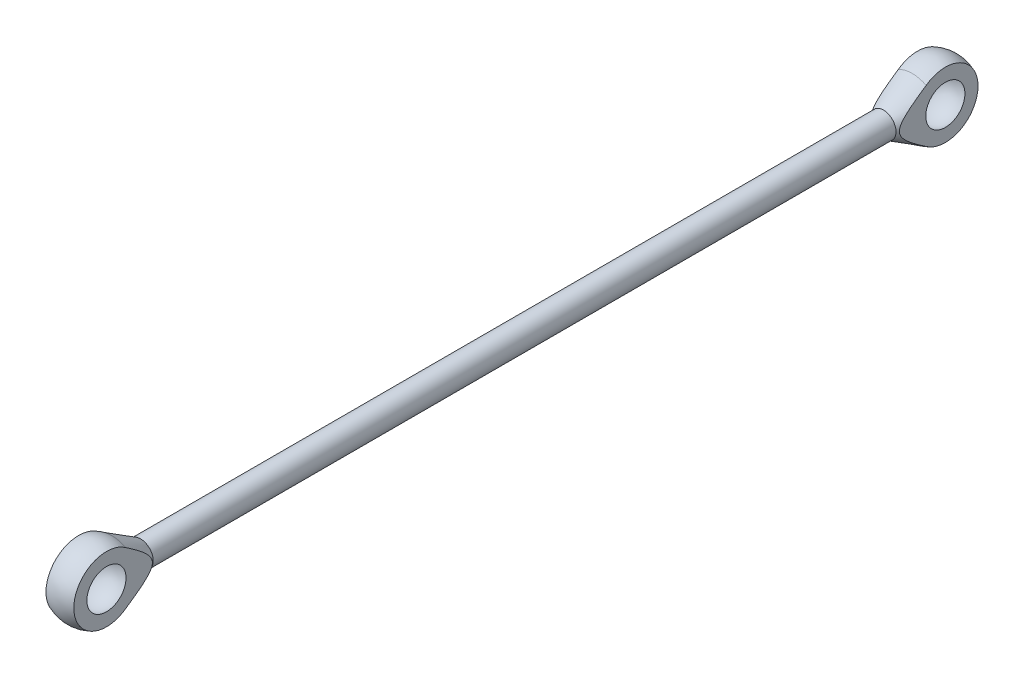
ISO-10303-21;
HEADER;
FILE_DESCRIPTION(('STEP AP214'),'2;1');
FILE_NAME('part.step','',(''),(''),'','','');
FILE_SCHEMA(('AUTOMOTIVE_DESIGN { 1 0 10303 214 1 1 1 1 }'));
ENDSEC;
DATA;
#1=APPLICATION_CONTEXT('core data for automotive mechanical design processes');
#2=APPLICATION_PROTOCOL_DEFINITION('international standard','automotive_design',2000,#1);
#3=PRODUCT_CONTEXT('',#1,'mechanical');
#4=PRODUCT('Part','Part','',(#3));
#5=PRODUCT_RELATED_PRODUCT_CATEGORY('part','',(#4));
#6=PRODUCT_DEFINITION_FORMATION('','',#4);
#7=PRODUCT_DEFINITION_CONTEXT('part definition',#1,'design');
#8=PRODUCT_DEFINITION('design','',#6,#7);
#9=PRODUCT_DEFINITION_SHAPE('','',#8);
#10=(LENGTH_UNIT() NAMED_UNIT(*) SI_UNIT(.MILLI.,.METRE.));
#11=(NAMED_UNIT(*) PLANE_ANGLE_UNIT() SI_UNIT($,.RADIAN.));
#12=(NAMED_UNIT(*) SI_UNIT($,.STERADIAN.) SOLID_ANGLE_UNIT());
#13=UNCERTAINTY_MEASURE_WITH_UNIT(LENGTH_MEASURE(1.E-05),#10,'distance_accuracy_value','');
#14=(GEOMETRIC_REPRESENTATION_CONTEXT(3) GLOBAL_UNCERTAINTY_ASSIGNED_CONTEXT((#13)) GLOBAL_UNIT_ASSIGNED_CONTEXT((#10,
#11,#12)) REPRESENTATION_CONTEXT('',''));
#15=CARTESIAN_POINT('',(0.,0.,0.));
#16=DIRECTION('',(0.,0.,1.));
#17=DIRECTION('',(1.,0.,0.));
#18=AXIS2_PLACEMENT_3D('',#15,#16,#17);
#19=CARTESIAN_POINT('',(0.,0.,19.01));
#20=DIRECTION('',(0.,0.,-1.));
#21=DIRECTION('',(-1.,0.,0.));
#22=AXIS2_PLACEMENT_3D('',#19,#20,#21);
#23=CONICAL_SURFACE('',#22,4.99999999999999,0.538562533862491);
#24=CARTESIAN_POINT('',(0.,0.,19.01));
#25=DIRECTION('',(0.,0.,1.));
#26=DIRECTION('',(1.,0.,0.));
#27=AXIS2_PLACEMENT_3D('',#24,#25,#26);
#28=CIRCLE('',#27,4.99999999999999);
#29=CARTESIAN_POINT('',(5.,0.,19.01));
#30=VERTEX_POINT('',#29);
#31=EDGE_CURVE('E97',#30,#30,#28,.T.);
#32=ORIENTED_EDGE('',*,*,#31,.F.);
#33=EDGE_LOOP('',(#32));
#34=FACE_BOUND('',#33,.T.);
#35=CARTESIAN_POINT('',(0.,0.,7.59617904313834));
#36=DIRECTION('',(0.,0.,-1.));
#37=DIRECTION('',(-1.,0.,0.));
#38=AXIS2_PLACEMENT_3D('',#35,#36,#37);
#39=CIRCLE('',#38,11.8194993102325);
#40=CARTESIAN_POINT('',(5.5,-10.4618623554598,7.59617904313834));
#41=VERTEX_POINT('',#40);
#42=CARTESIAN_POINT('',(-5.5,-10.4618623554598,7.59617904313835));
#43=VERTEX_POINT('',#42);
#44=EDGE_CURVE('E87',#41,#43,#39,.T.);
#45=ORIENTED_EDGE('',*,*,#44,.F.);
#46=CARTESIAN_POINT('',(5.5,-16.7699879539962,-2.16045450294229));
#47=CARTESIAN_POINT('',(5.5,-16.4583835907631,-1.66491515013046));
#48=CARTESIAN_POINT('',(5.5,-16.1461939178694,-1.16974273924281));
#49=CARTESIAN_POINT('',(5.5,-15.5203804705586,-0.18029928682494));
#50=CARTESIAN_POINT('',(5.5,-15.206756684022,0.313971747038282));
#51=CARTESIAN_POINT('',(5.5,-14.5777003040261,1.30161945901528));
#52=CARTESIAN_POINT('',(5.5,-14.2622670835569,1.79499573800298));
#53=CARTESIAN_POINT('',(5.5,-13.6293565999672,2.78043396123766));
#54=CARTESIAN_POINT('',(5.5,-13.3118793434821,3.27249590974389));
#55=CARTESIAN_POINT('',(5.5,-12.6745428201742,4.25482569199551));
#56=CARTESIAN_POINT('',(5.5,-12.3546844470516,4.74509410510819));
#57=CARTESIAN_POINT('',(5.5,-11.7118770373843,5.72359996355387));
#58=CARTESIAN_POINT('',(5.5,-11.3889280121858,6.21183741633325));
#59=CARTESIAN_POINT('',(5.5,-10.7391954567567,7.18561964861333));
#60=CARTESIAN_POINT('',(5.5,-10.4124126934105,7.67116493896215));
#61=CARTESIAN_POINT('',(5.5,-9.75383410271951,8.63883621135109));
#62=CARTESIAN_POINT('',(5.5,-9.42203836183317,9.12096225215252));
#63=CARTESIAN_POINT('',(5.5,-8.75202371300859,10.0803472501875));
#64=CARTESIAN_POINT('',(5.5,-8.41380853172558,10.5576087981055));
#65=CARTESIAN_POINT('',(5.5,-7.89967359976246,11.268687324336));
#66=CARTESIAN_POINT('',(5.5,-7.72713278963645,11.5049472711888));
#67=CARTESIAN_POINT('',(5.5,-7.37936653531155,11.9754836652112));
#68=CARTESIAN_POINT('',(5.5,-7.2041411110706,12.2097601271062));
#69=CARTESIAN_POINT('',(5.5,-6.84980688742612,12.6767789139711));
#70=CARTESIAN_POINT('',(5.5,-6.67068577499181,12.9095119134227));
#71=CARTESIAN_POINT('',(5.5,-6.30853675344257,13.3719165468175));
#72=CARTESIAN_POINT('',(5.5,-6.1255089421552,13.6015882571848));
#73=CARTESIAN_POINT('',(5.5,-5.75475390193778,14.0569173852053));
#74=CARTESIAN_POINT('',(5.5,-5.56702919950236,14.2825768538868));
#75=CARTESIAN_POINT('',(5.5,-5.18563251299146,14.7287987357815));
#76=CARTESIAN_POINT('',(5.5,-4.9919611436177,14.9493616717156));
#77=CARTESIAN_POINT('',(5.5,-4.59532986050416,15.3855828245892));
#78=CARTESIAN_POINT('',(5.5,-4.39230291252337,15.6011803605528));
#79=CARTESIAN_POINT('',(5.5,-3.97616836237411,16.0229155567571));
#80=CARTESIAN_POINT('',(5.5,-3.7630526000596,16.229045284197));
#81=CARTESIAN_POINT('',(5.5,-3.43431266643456,16.5270114574095));
#82=CARTESIAN_POINT('',(5.5,-3.32354493848511,16.6242050418075));
#83=CARTESIAN_POINT('',(5.5,-3.09834890812631,16.8142404870825));
#84=CARTESIAN_POINT('',(5.5,-2.98392121901322,16.9070830706913));
#85=CARTESIAN_POINT('',(5.5,-2.75104952147987,17.0872640153262));
#86=CARTESIAN_POINT('',(5.5,-2.63261145940299,17.174610020153));
#87=CARTESIAN_POINT('',(5.5,-2.39107305587329,17.3425526323686));
#88=CARTESIAN_POINT('',(5.5,-2.26797454793712,17.423151854821));
#89=CARTESIAN_POINT('',(5.5,-2.04513865625886,17.5585093754721));
#90=CARTESIAN_POINT('',(5.5,-1.94644813988529,17.6149781499614));
#91=CARTESIAN_POINT('',(5.5,-1.74584998022267,17.7218255956368));
#92=CARTESIAN_POINT('',(5.5,-1.64394212794569,17.7722038701727));
#93=CARTESIAN_POINT('',(5.5,-1.33345139230971,17.9123073875635));
#94=CARTESIAN_POINT('',(5.5,-1.11964427139642,17.991290577828));
#95=CARTESIAN_POINT('',(5.5,-0.808089736345844,18.075584022622));
#96=CARTESIAN_POINT('',(5.5,-0.714588861533277,18.0971036988214));
#97=CARTESIAN_POINT('',(5.5,-0.526159319821155,18.1324449338877));
#98=CARTESIAN_POINT('',(5.5,-0.431231401710393,18.1462703945237));
#99=CARTESIAN_POINT('',(5.5,-0.240555463549945,18.1657243374299));
#100=CARTESIAN_POINT('',(5.5,-0.144807617825735,18.1713545206171));
#101=CARTESIAN_POINT('',(5.5,0.0468168036116109,18.1742113228258));
#102=CARTESIAN_POINT('',(5.5,0.1426933816112,18.1714377905587));
#103=CARTESIAN_POINT('',(5.5,0.33370348182932,18.1576005628072));
#104=CARTESIAN_POINT('',(5.5,0.428837880309823,18.1465489012371));
#105=CARTESIAN_POINT('',(5.5,0.617874161148759,18.1165843613316));
#106=CARTESIAN_POINT('',(5.5,0.711775518008768,18.0976682367479));
#107=CARTESIAN_POINT('',(5.5,0.990823929511157,18.0300264663378));
#108=CARTESIAN_POINT('',(5.5,1.173389722865,17.9704012488984));
#109=CARTESIAN_POINT('',(5.5,1.50044770452012,17.8398452116475));
#110=CARTESIAN_POINT('',(5.5,1.64634286874576,17.772272151952));
#111=CARTESIAN_POINT('',(5.5,1.93170387943562,17.624532878355));
#112=CARTESIAN_POINT('',(5.5,2.07116462975958,17.5443568969561));
#113=CARTESIAN_POINT('',(5.5,2.3445661171153,17.3739123699473));
#114=CARTESIAN_POINT('',(5.5,2.47847917963017,17.28360001701));
#115=CARTESIAN_POINT('',(5.5,2.74076622119365,17.0954142226783));
#116=CARTESIAN_POINT('',(5.5,2.86914219208851,16.9975435361839));
#117=CARTESIAN_POINT('',(5.5,3.10532713311943,16.8084873877856));
#118=CARTESIAN_POINT('',(5.5,3.21369861274597,16.7179993405327));
#119=CARTESIAN_POINT('',(5.5,3.42722218337715,16.5332914600831));
#120=CARTESIAN_POINT('',(5.5,3.53237390558656,16.439071202208));
#121=CARTESIAN_POINT('',(5.5,3.84370823383102,16.1517227777822));
#122=CARTESIAN_POINT('',(5.5,4.04565301165459,15.9540028254144));
#123=CARTESIAN_POINT('',(5.5,4.44122638644227,15.549565695216));
#124=CARTESIAN_POINT('',(5.5,4.63483326886779,15.3428275508764));
#125=CARTESIAN_POINT('',(5.5,5.01505488168435,14.9231520340683));
#126=CARTESIAN_POINT('',(5.5,5.20167160469701,14.7102164594794));
#127=CARTESIAN_POINT('',(5.5,5.57120857287385,14.2774931520359));
#128=CARTESIAN_POINT('',(5.5,5.7540733012956,14.0576582295168));
#129=CARTESIAN_POINT('',(5.5,6.11525587117383,13.6142723168627));
#130=CARTESIAN_POINT('',(5.5,6.29357342764499,13.3907210952591));
#131=CARTESIAN_POINT('',(5.5,6.64619362154478,12.9410532101398));
#132=CARTESIAN_POINT('',(5.5,6.82050217516087,12.7149411749489));
#133=CARTESIAN_POINT('',(5.5,7.16602299801056,12.260379434849));
#134=CARTESIAN_POINT('',(5.5,7.33723536788028,12.0319298062989));
#135=CARTESIAN_POINT('',(5.5,7.68035099807539,11.5686783755692));
#136=CARTESIAN_POINT('',(5.5,7.8522036530824,11.3338391403543));
#137=CARTESIAN_POINT('',(5.5,8.19362961978857,10.8625083528705));
#138=CARTESIAN_POINT('',(5.5,8.36320290901521,10.6260167843461));
#139=CARTESIAN_POINT('',(5.5,8.86903578254858,9.91445950528944));
#140=CARTESIAN_POINT('',(5.5,9.2023938426723,9.43733097062447));
#141=CARTESIAN_POINT('',(5.5,9.86340753782228,8.47902883665836));
#142=CARTESIAN_POINT('',(5.5,10.191062139348,7.99785452719066));
#143=CARTESIAN_POINT('',(5.5,10.8419438891723,7.03251702334353));
#144=CARTESIAN_POINT('',(5.5,11.1651709920418,6.54835379836964));
#145=CARTESIAN_POINT('',(5.5,11.8085969461061,5.57704840658271));
#146=CARTESIAN_POINT('',(5.5,12.1287909324369,5.08990302160346));
#147=CARTESIAN_POINT('',(5.5,12.7663902158809,4.11378869362987));
#148=CARTESIAN_POINT('',(5.5,13.0837954988512,3.62481974140519));
#149=CARTESIAN_POINT('',(5.5,13.7163028517257,2.64547328295726));
#150=CARTESIAN_POINT('',(5.5,14.0314051763908,2.15509594115797));
#151=CARTESIAN_POINT('',(5.5,14.6597388439089,1.17314365485102));
#152=CARTESIAN_POINT('',(5.5,14.972970183747,0.681568708415411));
#153=CARTESIAN_POINT('',(5.5,15.8624532489958,-0.719227222601899));
#154=CARTESIAN_POINT('',(5.5,16.4368340285493,-1.62963613034259));
#155=CARTESIAN_POINT('',(5.5,17.581730623258,-3.45292026726319));
#156=CARTESIAN_POINT('',(5.5,18.1522463077453,-4.36579557838019));
#157=CARTESIAN_POINT('',(5.5,19.2890871726645,-6.1913693757879));
#158=CARTESIAN_POINT('',(5.5,19.8554188047434,-7.10406384683818));
#159=CARTESIAN_POINT('',(5.5,20.9857480065165,-8.93084479912671));
#160=CARTESIAN_POINT('',(5.5,21.5497456723615,-9.84493122085618));
#161=CARTESIAN_POINT('',(5.5,22.1128967464632,-10.7595365618902));
#162=B_SPLINE_CURVE_WITH_KNOTS('',3,(#46,#47,#48,#49,#50,#51,#52,#53,#54,#55,#56,#57,#58,#59,
#60,#61,#62,#63,#64,#65,#66,#67,#68,#69,#70,#71,#72,#73,#74,#75,#76,#77,#78,#79,#80,#81,#82,#83,
#84,#85,#86,#87,#88,#89,#90,#91,#92,#93,#94,#95,#96,#97,#98,#99,#100,#101,#102,#103,#104,#105,
#106,#107,#108,#109,#110,#111,#112,#113,#114,#115,#116,#117,#118,#119,#120,#121,#122,#123,#124,
#125,#126,#127,#128,#129,#130,#131,#132,#133,#134,#135,#136,#137,#138,#139,#140,#141,#142,#143,
#144,#145,#146,#147,#148,#149,#150,#151,#152,#153,#154,#155,#156,#157,#158,#159,#160,#161),
.UNSPECIFIED.,.F.,.F.,(4,2,2,2,2,2,2,2,2,2,2,2,2,2,2,2,2,2,2,2,2,2,2,2,2,2,2,2,2,2,2,2,2,2,2,2,
2,2,2,2,2,2,2,2,2,2,2,2,2,2,2,2,2,2,2,2,2,4),(0.,1.75610713310404,3.5122291343948,
5.26900166542934,7.02576849649388,8.78190623585405,10.5380375307609,12.2938233316964,
14.0495788852004,15.8043445939417,16.6819982396022,17.5596453637789,18.4406573546675,
19.3216473099765,20.2021731511598,21.0826082775663,21.9708351720946,22.8597931943429,
23.3017992579977,23.7437316391958,24.1850352103557,24.6261669317779,24.9670709599009,
25.3079971778144,25.9882375170686,26.2758209935853,26.5632585021152,26.8506363449284,
27.1380193613142,27.4249854179101,27.712070044517,28.2860179312195,28.7677105623651,
29.2497783717602,29.7340162246122,30.2180784054978,30.641528455303,31.0650268275612,
31.9124765134433,32.7620140789376,33.6113076023004,34.4690815139111,35.3269090533902,
36.183376808251,37.0398166748846,37.9128096339599,38.7858111936671,40.531887858675,
42.2782776968377,44.0246854407365,45.7735345079786,47.522392439404,49.2710538856181,
51.0197181487522,54.2490711276736,57.4785327424446,60.7009013782807,63.9231359160152),.UNSPECIFIED.);
#163=CARTESIAN_POINT('',(5.5,10.4618623554598,7.59617904313834));
#164=VERTEX_POINT('',#163);
#165=EDGE_CURVE('E60',#41,#164,#162,.T.);
#166=ORIENTED_EDGE('',*,*,#165,.T.);
#167=CARTESIAN_POINT('',(-5.5,10.4618623554598,7.59617904313835));
#168=VERTEX_POINT('',#167);
#169=EDGE_CURVE('E86',#168,#164,#39,.T.);
#170=ORIENTED_EDGE('',*,*,#169,.F.);
#171=CARTESIAN_POINT('',(-5.5,-16.7699879539963,-2.16045450294229));
#172=CARTESIAN_POINT('',(-5.5,-16.4583835907631,-1.66491515013046));
#173=CARTESIAN_POINT('',(-5.5,-16.1461939178694,-1.16974273924281));
#174=CARTESIAN_POINT('',(-5.5,-15.5203804705586,-0.180299286824941));
#175=CARTESIAN_POINT('',(-5.5,-15.206756684022,0.31397174703828));
#176=CARTESIAN_POINT('',(-5.5,-14.5777003040261,1.30161945901528));
#177=CARTESIAN_POINT('',(-5.5,-14.2622670835569,1.79499573800298));
#178=CARTESIAN_POINT('',(-5.5,-13.6293565999672,2.78043396123766));
#179=CARTESIAN_POINT('',(-5.5,-13.3118793434821,3.27249590974389));
#180=CARTESIAN_POINT('',(-5.5,-12.6745428201742,4.25482569199551));
#181=CARTESIAN_POINT('',(-5.5,-12.3546844470516,4.74509410510819));
#182=CARTESIAN_POINT('',(-5.5,-11.7118770373843,5.72359996355386));
#183=CARTESIAN_POINT('',(-5.5,-11.3889280121858,6.21183741633325));
#184=CARTESIAN_POINT('',(-5.5,-10.7391954567567,7.18561964861333));
#185=CARTESIAN_POINT('',(-5.5,-10.4124126934105,7.67116493896215));
#186=CARTESIAN_POINT('',(-5.5,-9.75383410271951,8.63883621135109));
#187=CARTESIAN_POINT('',(-5.5,-9.42203836183317,9.12096225215252));
#188=CARTESIAN_POINT('',(-5.5,-8.75202371300859,10.0803472501875));
#189=CARTESIAN_POINT('',(-5.5,-8.41380853172558,10.5576087981055));
#190=CARTESIAN_POINT('',(-5.5,-7.89967359976246,11.268687324336));
#191=CARTESIAN_POINT('',(-5.5,-7.72713278963645,11.5049472711888));
#192=CARTESIAN_POINT('',(-5.5,-7.37936653531155,11.9754836652112));
#193=CARTESIAN_POINT('',(-5.5,-7.2041411110706,12.2097601271062));
#194=CARTESIAN_POINT('',(-5.5,-6.84980688742612,12.6767789139711));
#195=CARTESIAN_POINT('',(-5.5,-6.67068577499181,12.9095119134227));
#196=CARTESIAN_POINT('',(-5.5,-6.30853675344257,13.3719165468175));
#197=CARTESIAN_POINT('',(-5.5,-6.12550894215519,13.6015882571847));
#198=CARTESIAN_POINT('',(-5.5,-5.75475390193778,14.0569173852053));
#199=CARTESIAN_POINT('',(-5.5,-5.56702919950236,14.2825768538868));
#200=CARTESIAN_POINT('',(-5.5,-5.18563251299146,14.7287987357815));
#201=CARTESIAN_POINT('',(-5.5,-4.9919611436177,14.9493616717156));
#202=CARTESIAN_POINT('',(-5.5,-4.59532986050415,15.3855828245892));
#203=CARTESIAN_POINT('',(-5.5,-4.39230291252336,15.6011803605528));
#204=CARTESIAN_POINT('',(-5.5,-3.97616836237409,16.0229155567571));
#205=CARTESIAN_POINT('',(-5.5,-3.76305260005959,16.229045284197));
#206=CARTESIAN_POINT('',(-5.5,-3.43431266643454,16.5270114574095));
#207=CARTESIAN_POINT('',(-5.5,-3.32354493848509,16.6242050418075));
#208=CARTESIAN_POINT('',(-5.5,-3.0983489081263,16.8142404870825));
#209=CARTESIAN_POINT('',(-5.5,-2.98392121901321,16.9070830706913));
#210=CARTESIAN_POINT('',(-5.5,-2.75104952147986,17.0872640153262));
#211=CARTESIAN_POINT('',(-5.5,-2.63261145940297,17.174610020153));
#212=CARTESIAN_POINT('',(-5.5,-2.39107305587327,17.3425526323686));
#213=CARTESIAN_POINT('',(-5.5,-2.2679745479371,17.423151854821));
#214=CARTESIAN_POINT('',(-5.5,-2.04513865625884,17.5585093754721));
#215=CARTESIAN_POINT('',(-5.5,-1.94644813988527,17.6149781499614));
#216=CARTESIAN_POINT('',(-5.5,-1.74584998022265,17.7218255956368));
#217=CARTESIAN_POINT('',(-5.5,-1.64394212794567,17.7722038701727));
#218=CARTESIAN_POINT('',(-5.5,-1.33345139230969,17.9123073875635));
#219=CARTESIAN_POINT('',(-5.5,-1.1196442713964,17.991290577828));
#220=CARTESIAN_POINT('',(-5.5,-0.808089736345827,18.075584022622));
#221=CARTESIAN_POINT('',(-5.5,-0.71458886153326,18.0971036988214));
#222=CARTESIAN_POINT('',(-5.5,-0.526159319821139,18.1324449338877));
#223=CARTESIAN_POINT('',(-5.5,-0.431231401710376,18.1462703945237));
#224=CARTESIAN_POINT('',(-5.5,-0.240555463549928,18.1657243374299));
#225=CARTESIAN_POINT('',(-5.5,-0.144807617825718,18.1713545206171));
#226=CARTESIAN_POINT('',(-5.5,0.0468168036116287,18.1742113228258));
#227=CARTESIAN_POINT('',(-5.5,0.142693381611219,18.1714377905587));
#228=CARTESIAN_POINT('',(-5.5,0.33370348182934,18.1576005628072));
#229=CARTESIAN_POINT('',(-5.5,0.428837880309844,18.146548901237));
#230=CARTESIAN_POINT('',(-5.5,0.617874161148779,18.1165843613316));
#231=CARTESIAN_POINT('',(-5.5,0.711775518008788,18.0976682367479));
#232=CARTESIAN_POINT('',(-5.5,0.990823929511178,18.0300264663378));
#233=CARTESIAN_POINT('',(-5.5,1.17338972286502,17.9704012488984));
#234=CARTESIAN_POINT('',(-5.5,1.50044770452015,17.8398452116475));
#235=CARTESIAN_POINT('',(-5.5,1.64634286874579,17.7722721519519));
#236=CARTESIAN_POINT('',(-5.5,1.93170387943565,17.624532878355));
#237=CARTESIAN_POINT('',(-5.5,2.07116462975961,17.5443568969561));
#238=CARTESIAN_POINT('',(-5.5,2.34456611711533,17.3739123699472));
#239=CARTESIAN_POINT('',(-5.5,2.47847917963021,17.28360001701));
#240=CARTESIAN_POINT('',(-5.5,2.74076622119368,17.0954142226782));
#241=CARTESIAN_POINT('',(-5.5,2.86914219208855,16.9975435361839));
#242=CARTESIAN_POINT('',(-5.5,3.10532713311947,16.8084873877855));
#243=CARTESIAN_POINT('',(-5.5,3.21369861274602,16.7179993405327));
#244=CARTESIAN_POINT('',(-5.5,3.4272221833772,16.5332914600831));
#245=CARTESIAN_POINT('',(-5.5,3.53237390558661,16.439071202208));
#246=CARTESIAN_POINT('',(-5.5,3.84370823383107,16.1517227777821));
#247=CARTESIAN_POINT('',(-5.5,4.04565301165465,15.9540028254143));
#248=CARTESIAN_POINT('',(-5.5,4.44122638644233,15.549565695216));
#249=CARTESIAN_POINT('',(-5.5,4.63483326886786,15.3428275508763));
#250=CARTESIAN_POINT('',(-5.5,5.01505488168442,14.9231520340682));
#251=CARTESIAN_POINT('',(-5.5,5.20167160469709,14.7102164594793));
#252=CARTESIAN_POINT('',(-5.5,5.57120857287393,14.2774931520358));
#253=CARTESIAN_POINT('',(-5.5,5.75407330129568,14.0576582295167));
#254=CARTESIAN_POINT('',(-5.5,6.11525587117392,13.6142723168626));
#255=CARTESIAN_POINT('',(-5.5,6.29357342764508,13.390721095259));
#256=CARTESIAN_POINT('',(-5.5,6.64619362154488,12.9410532101396));
#257=CARTESIAN_POINT('',(-5.5,6.82050217516098,12.7149411749487));
#258=CARTESIAN_POINT('',(-5.5,7.16602299801067,12.2603794348489));
#259=CARTESIAN_POINT('',(-5.5,7.33723536788039,12.0319298062987));
#260=CARTESIAN_POINT('',(-5.5,7.68035099807551,11.5686783755691));
#261=CARTESIAN_POINT('',(-5.5,7.85220365308253,11.3338391403541));
#262=CARTESIAN_POINT('',(-5.5,8.19362961978871,10.8625083528703));
#263=CARTESIAN_POINT('',(-5.5,8.36320290901535,10.6260167843459));
#264=CARTESIAN_POINT('',(-5.5,8.86903578254873,9.91445950528924));
#265=CARTESIAN_POINT('',(-5.5,9.20239384267245,9.43733097062425));
#266=CARTESIAN_POINT('',(-5.5,9.86340753782244,8.47902883665812));
#267=CARTESIAN_POINT('',(-5.5,10.1910621393481,7.9978545271904));
#268=CARTESIAN_POINT('',(-5.5,10.8419438891725,7.03251702334325));
#269=CARTESIAN_POINT('',(-5.5,11.165170992042,6.54835379836935));
#270=CARTESIAN_POINT('',(-5.5,11.8085969461063,5.5770484065824));
#271=CARTESIAN_POINT('',(-5.5,12.1287909324371,5.08990302160314));
#272=CARTESIAN_POINT('',(-5.5,12.7663902158811,4.11378869362953));
#273=CARTESIAN_POINT('',(-5.5,13.0837954988514,3.62481974140483));
#274=CARTESIAN_POINT('',(-5.5,13.716302851726,2.64547328295689));
#275=CARTESIAN_POINT('',(-5.5,14.0314051763911,2.15509594115759));
#276=CARTESIAN_POINT('',(-5.5,14.6597388439092,1.17314365485061));
#277=CARTESIAN_POINT('',(-5.5,14.9729701837473,0.681568708414989));
#278=CARTESIAN_POINT('',(-5.5,15.8624532489961,-0.719227222602354));
#279=CARTESIAN_POINT('',(-5.5,16.4368340285496,-1.62963613034306));
#280=CARTESIAN_POINT('',(-5.5,17.5817306232583,-3.4529202672637));
#281=CARTESIAN_POINT('',(-5.5,18.1522463077457,-4.36579557838072));
#282=CARTESIAN_POINT('',(-5.5,19.2890871726649,-6.19136937578847));
#283=CARTESIAN_POINT('',(-5.5,19.8554188047438,-7.10406384683877));
#284=CARTESIAN_POINT('',(-5.5,20.9857480065169,-8.93084479912733));
#285=CARTESIAN_POINT('',(-5.5,21.5497456723619,-9.84493122085683));
#286=CARTESIAN_POINT('',(-5.5,22.1128967464636,-10.7595365618908));
#287=B_SPLINE_CURVE_WITH_KNOTS('',3,(#171,#172,#173,#174,#175,#176,#177,#178,#179,#180,#181,
#182,#183,#184,#185,#186,#187,#188,#189,#190,#191,#192,#193,#194,#195,#196,#197,#198,#199,#200,
#201,#202,#203,#204,#205,#206,#207,#208,#209,#210,#211,#212,#213,#214,#215,#216,#217,#218,#219,
#220,#221,#222,#223,#224,#225,#226,#227,#228,#229,#230,#231,#232,#233,#234,#235,#236,#237,#238,
#239,#240,#241,#242,#243,#244,#245,#246,#247,#248,#249,#250,#251,#252,#253,#254,#255,#256,#257,
#258,#259,#260,#261,#262,#263,#264,#265,#266,#267,#268,#269,#270,#271,#272,#273,#274,#275,#276,
#277,#278,#279,#280,#281,#282,#283,#284,#285,#286),.UNSPECIFIED.,.F.,.F.,(4,2,2,2,2,2,2,2,2,2,2,
2,2,2,2,2,2,2,2,2,2,2,2,2,2,2,2,2,2,2,2,2,2,2,2,2,2,2,2,2,2,2,2,2,2,2,2,2,2,2,2,2,2,2,2,2,2,4),
(0.,1.75610713310404,3.5122291343948,5.26900166542935,7.02576849649389,8.78190623585406,
10.538037530761,12.2938233316964,14.0495788852004,15.8043445939417,16.6819982396022,
17.5596453637789,18.4406573546675,19.3216473099765,20.2021731511598,21.0826082775663,
21.9708351720946,22.8597931943429,23.3017992579978,23.7437316391958,24.1850352103557,
24.6261669317779,24.967070959901,25.3079971778144,25.9882375170686,26.2758209935853,
26.5632585021152,26.8506363449285,27.1380193613142,27.4249854179101,27.712070044517,
28.2860179312196,28.7677105623651,29.2497783717602,29.7340162246122,30.2180784054979,
30.6415284553031,31.0650268275613,31.9124765134434,32.7620140789377,33.6113076023005,
34.4690815139112,35.3269090533904,36.1833768082511,37.0398166748848,37.9128096339601,
38.7858111936673,40.5318878586752,42.2782776968381,44.0246854407368,45.773534507979,
47.5223924394045,49.2710538856186,51.0197181487528,54.2490711276742,57.4785327424452,
60.7009013782814,63.923135916016),.UNSPECIFIED.);
#288=EDGE_CURVE('E151',#43,#168,#287,.T.);
#289=ORIENTED_EDGE('',*,*,#288,.F.);
#290=EDGE_LOOP('',(#45,#166,#170,#289));
#291=FACE_BOUND('',#290,.T.);
#292=ADVANCED_FACE('F38',(#34,#291),#23,.T.);
#293=CARTESIAN_POINT('',(0.,0.,0.));
#294=DIRECTION('',(-1.,0.,0.));
#295=DIRECTION('',(0.,0.,-1.));
#296=AXIS2_PLACEMENT_3D('',#293,#294,#295);
#297=SPHERICAL_SURFACE('',#296,14.05);
#298=CARTESIAN_POINT('',(5.5,0.,0.));
#299=DIRECTION('',(1.,0.,0.));
#300=DIRECTION('',(0.,0.,-1.));
#301=AXIS2_PLACEMENT_3D('',#298,#299,#300);
#302=CIRCLE('',#301,12.9287470390599);
#303=EDGE_CURVE('E47',#41,#164,#302,.T.);
#304=ORIENTED_EDGE('',*,*,#303,.F.);
#305=ORIENTED_EDGE('',*,*,#44,.T.);
#306=CARTESIAN_POINT('',(-5.5,0.,0.));
#307=DIRECTION('',(1.,0.,0.));
#308=DIRECTION('',(0.,0.,-1.));
#309=AXIS2_PLACEMENT_3D('',#306,#307,#308);
#310=CIRCLE('',#309,12.9287470390599);
#311=EDGE_CURVE('E81',#43,#168,#310,.T.);
#312=ORIENTED_EDGE('',*,*,#311,.T.);
#313=ORIENTED_EDGE('',*,*,#169,.T.);
#314=EDGE_LOOP('',(#304,#305,#312,#313));
#315=FACE_BOUND('',#314,.T.);
#316=ADVANCED_FACE('F91',(#315),#297,.T.);
#317=CARTESIAN_POINT('',(0.,0.,312.99));
#318=DIRECTION('',(0.,0.,1.));
#319=DIRECTION('',(1.,0.,0.));
#320=AXIS2_PLACEMENT_3D('',#317,#318,#319);
#321=CONICAL_SURFACE('',#320,5.,0.538562533862491);
#322=CARTESIAN_POINT('',(5.5,-34.9501394742823,363.837539391228));
#323=CARTESIAN_POINT('',(5.5,-34.4364681528596,362.988260149985));
#324=CARTESIAN_POINT('',(5.5,-33.9225991303741,362.139100498219));
#325=CARTESIAN_POINT('',(5.5,-32.8944017829057,360.441059105531));
#326=CARTESIAN_POINT('',(5.5,-32.3800734578382,359.592177364659));
#327=CARTESIAN_POINT('',(5.5,-30.836283285509,357.045973473157));
#328=CARTESIAN_POINT('',(5.5,-29.8060368756524,355.349126781377));
#329=CARTESIAN_POINT('',(5.5,-27.7418657849275,351.955748433576));
#330=CARTESIAN_POINT('',(5.5,-26.7079387663162,350.259218199291));
#331=CARTESIAN_POINT('',(5.5,-24.636160928299,346.868593226401));
#332=CARTESIAN_POINT('',(5.5,-23.5983101771776,345.174498446113));
#333=CARTESIAN_POINT('',(5.5,-22.0565820834211,342.667564137746));
#334=CARTESIAN_POINT('',(5.5,-21.5549306313216,341.853355828866));
#335=CARTESIAN_POINT('',(5.5,-20.5499690535865,340.225963710984));
#336=CARTESIAN_POINT('',(5.5,-20.0466589288114,339.412779901451));
#337=CARTESIAN_POINT('',(5.5,-19.0379555072413,337.7876448665));
#338=CARTESIAN_POINT('',(5.5,-18.5325621010715,336.975693708941));
#339=CARTESIAN_POINT('',(5.5,-17.5191759935572,335.353417357634));
#340=CARTESIAN_POINT('',(5.5,-17.0111832994177,334.543092159388));
#341=CARTESIAN_POINT('',(5.5,-15.9920704148961,332.924910200916));
#342=CARTESIAN_POINT('',(5.5,-15.4809517100401,332.117052506025));
#343=CARTESIAN_POINT('',(5.5,-14.4542849258779,330.504159460424));
#344=CARTESIAN_POINT('',(5.5,-13.9387368662807,329.699124097178));
#345=CARTESIAN_POINT('',(5.5,-12.9016650510381,328.092993862521));
#346=CARTESIAN_POINT('',(5.5,-12.3801417884284,327.291898673678));
#347=CARTESIAN_POINT('',(5.5,-11.5914474798901,326.094489501023));
#348=CARTESIAN_POINT('',(5.5,-11.3274840149819,325.696062974687));
#349=CARTESIAN_POINT('',(5.5,-10.7969499741552,324.900950489227));
#350=CARTESIAN_POINT('',(5.5,-10.530379414718,324.504264519121));
#351=CARTESIAN_POINT('',(5.5,-10.0947367190021,323.861611475168));
#352=CARTESIAN_POINT('',(5.5,-9.92664070288981,323.614982653024));
#353=CARTESIAN_POINT('',(5.5,-9.58901345853979,323.122706785141));
#354=CARTESIAN_POINT('',(5.5,-9.41948222300252,322.877059744404));
#355=CARTESIAN_POINT('',(5.5,-9.07872286062061,322.386852512534));
#356=CARTESIAN_POINT('',(5.5,-8.90749431551543,322.142292611944));
#357=CARTESIAN_POINT('',(5.5,-8.56311345780951,321.654530561022));
#358=CARTESIAN_POINT('',(5.5,-8.38996114889937,321.411328408086));
#359=CARTESIAN_POINT('',(5.5,-8.03933302523104,320.923668724854));
#360=CARTESIAN_POINT('',(5.5,-7.86183028850385,320.679230529652));
#361=CARTESIAN_POINT('',(5.5,-7.50408657425455,320.192365992874));
#362=CARTESIAN_POINT('',(5.5,-7.32384561780295,319.949939635839));
#363=CARTESIAN_POINT('',(5.5,-6.96019261984707,319.467712162013));
#364=CARTESIAN_POINT('',(5.5,-6.77678264298003,319.227909490737));
#365=CARTESIAN_POINT('',(5.5,-6.40598538612366,318.751399039277));
#366=CARTESIAN_POINT('',(5.5,-6.21859820870244,318.514691179535));
#367=CARTESIAN_POINT('',(5.5,-5.8850094762513,318.102223552241));
#368=CARTESIAN_POINT('',(5.5,-5.7398538086417,317.925618800114));
#369=CARTESIAN_POINT('',(5.5,-5.44621688888457,317.575198885466));
#370=CARTESIAN_POINT('',(5.5,-5.29773575022323,317.401383628097));
#371=CARTESIAN_POINT('',(5.5,-4.99645299794637,317.056819568112));
#372=CARTESIAN_POINT('',(5.5,-4.8436422040105,316.886078768341));
#373=CARTESIAN_POINT('',(5.5,-4.5332190706864,316.54902643091));
#374=CARTESIAN_POINT('',(5.5,-4.37560713577643,316.382714522332));
#375=CARTESIAN_POINT('',(5.5,-4.05643170191936,316.057762101366));
#376=CARTESIAN_POINT('',(5.5,-3.89493749012053,315.899053877748));
#377=CARTESIAN_POINT('',(5.5,-3.56486546260441,315.588977622158));
#378=CARTESIAN_POINT('',(5.5,-3.39628473783525,315.437612660657));
#379=CARTESIAN_POINT('',(5.5,-3.05119930132742,315.145567963997));
#380=CARTESIAN_POINT('',(5.5,-2.87472900725895,315.004847884813));
#381=CARTESIAN_POINT('',(5.5,-2.51149691044092,314.737496212443));
#382=CARTESIAN_POINT('',(5.5,-2.32474695428753,314.610848889443));
#383=CARTESIAN_POINT('',(5.5,-2.02469828278501,314.42936402903));
#384=CARTESIAN_POINT('',(5.5,-1.91558998478585,314.36760425038));
#385=CARTESIAN_POINT('',(5.5,-1.69334625381985,314.251645109415));
#386=CARTESIAN_POINT('',(5.5,-1.58020971280428,314.197447847805));
#387=CARTESIAN_POINT('',(5.5,-1.35032286265664,314.098411453633));
#388=CARTESIAN_POINT('',(5.5,-1.23358587875705,314.053541683645));
#389=CARTESIAN_POINT('',(5.5,-0.996498933530541,313.97470642012));
#390=CARTESIAN_POINT('',(5.5,-0.876151103296831,313.940734627921));
#391=CARTESIAN_POINT('',(5.5,-0.661102488374714,313.891822299828));
#392=CARTESIAN_POINT('',(5.5,-0.566989736062261,313.874288642581));
#393=CARTESIAN_POINT('',(5.5,-0.377623168066541,313.847173735601));
#394=CARTESIAN_POINT('',(5.5,-0.282369521229813,313.837591323523));
#395=CARTESIAN_POINT('',(5.5,-0.0913375078825211,313.826734014491));
#396=CARTESIAN_POINT('',(5.5,0.00444110092397937,313.825463346446));
#397=CARTESIAN_POINT('',(5.5,0.195745028032402,313.831288825723));
#398=CARTESIAN_POINT('',(5.5,0.291270334112952,313.838385369643));
#399=CARTESIAN_POINT('',(5.5,0.481010047606842,313.860636382901));
#400=CARTESIAN_POINT('',(5.5,0.575228012949751,313.875760733865));
#401=CARTESIAN_POINT('',(5.5,0.762162383064895,313.9135168544));
#402=CARTESIAN_POINT('',(5.5,0.854878139947756,313.936151777328));
#403=CARTESIAN_POINT('',(5.5,1.1300378412261,314.014281235697));
#404=CARTESIAN_POINT('',(5.5,1.30962041054213,314.080016806343));
#405=CARTESIAN_POINT('',(5.5,1.64253024308573,314.22517167423));
#406=CARTESIAN_POINT('',(5.5,1.79672512218363,314.3026783922));
#407=CARTESIAN_POINT('',(5.5,2.09784368713473,314.470883992836));
#408=CARTESIAN_POINT('',(5.5,2.24476082618354,314.561594474338));
#409=CARTESIAN_POINT('',(5.5,2.53257820497079,314.753463229267));
#410=CARTESIAN_POINT('',(5.5,2.67344513505783,314.854670902226));
#411=CARTESIAN_POINT('',(5.5,2.88026723765427,315.012228232801));
#412=CARTESIAN_POINT('',(5.5,2.94845030644017,315.065695368829));
#413=CARTESIAN_POINT('',(5.5,3.08344717969999,315.174331540053));
#414=CARTESIAN_POINT('',(5.5,3.15026099636813,315.229500560079));
#415=CARTESIAN_POINT('',(5.5,3.34082874523214,315.390512075657));
#416=CARTESIAN_POINT('',(5.5,3.46298296054434,315.498250058035));
#417=CARTESIAN_POINT('',(5.5,3.70344846092966,315.717946317212));
#418=CARTESIAN_POINT('',(5.5,3.8217590776156,315.829905320795));
#419=CARTESIAN_POINT('',(5.5,4.0551210588023,316.057300025568));
#420=CARTESIAN_POINT('',(5.5,4.17017041543157,316.172737782029));
#421=CARTESIAN_POINT('',(5.5,4.39738593321328,316.406422033999));
#422=CARTESIAN_POINT('',(5.5,4.50955190045288,316.524668717388));
#423=CARTESIAN_POINT('',(5.5,4.84280251499263,316.883419436454));
#424=CARTESIAN_POINT('',(5.5,5.06012216985968,317.127421572363));
#425=CARTESIAN_POINT('',(5.5,5.48710306426018,317.622036608412));
#426=CARTESIAN_POINT('',(5.5,5.69676328637779,317.872650379229));
#427=CARTESIAN_POINT('',(5.5,6.00764223161443,318.253358493499));
#428=CARTESIAN_POINT('',(5.5,6.11110830235904,318.381627121971));
#429=CARTESIAN_POINT('',(5.5,6.31666391660005,318.639246993027));
#430=CARTESIAN_POINT('',(5.5,6.41875356224147,318.768598154108));
#431=CARTESIAN_POINT('',(5.5,6.7232161774606,319.158103632897));
#432=CARTESIAN_POINT('',(5.5,6.92376324976253,319.419685847885));
#433=CARTESIAN_POINT('',(5.5,7.32059480255041,319.94537463));
#434=CARTESIAN_POINT('',(5.5,7.51688578642777,320.209476304627));
#435=CARTESIAN_POINT('',(5.5,7.90624255581743,320.74002992039));
#436=CARTESIAN_POINT('',(5.5,8.09930844813863,321.006481783242));
#437=CARTESIAN_POINT('',(5.5,8.48589200200063,321.545660055527));
#438=CARTESIAN_POINT('',(5.5,8.67936570901712,321.818417937106));
#439=CARTESIAN_POINT('',(5.5,9.0639953196599,322.36556413827));
#440=CARTESIAN_POINT('',(5.5,9.25515120564306,322.639952470243));
#441=CARTESIAN_POINT('',(5.5,9.82570379555062,323.465159335262));
#442=CARTESIAN_POINT('',(5.5,10.2021728410165,324.018002068815));
#443=CARTESIAN_POINT('',(5.5,10.9494245574307,325.127617671826));
#444=CARTESIAN_POINT('',(5.5,11.3202064171474,325.684391085725));
#445=CARTESIAN_POINT('',(5.5,12.0574030519655,326.800824754553));
#446=CARTESIAN_POINT('',(5.5,12.4238177933039,327.360485031752));
#447=CARTESIAN_POINT('',(5.5,13.1537067781423,328.482721517181));
#448=CARTESIAN_POINT('',(5.5,13.5171767313042,329.045300512366));
#449=CARTESIAN_POINT('',(5.5,14.2414103620598,330.172199658527));
#450=CARTESIAN_POINT('',(5.5,14.6021740288721,330.736519816429));
#451=CARTESIAN_POINT('',(5.5,15.3214833446207,331.866501573302));
#452=CARTESIAN_POINT('',(5.5,15.6800291853603,332.432163050249));
#453=CARTESIAN_POINT('',(5.5,16.3953267382638,333.564619556979));
#454=CARTESIAN_POINT('',(5.5,16.7520784483869,334.131414588049));
#455=CARTESIAN_POINT('',(5.5,17.77103494947,335.754993803032));
#456=CARTESIAN_POINT('',(5.5,18.4314131352514,336.812924267013));
#457=CARTESIAN_POINT('',(5.5,19.7484608590511,338.931127410621));
#458=CARTESIAN_POINT('',(5.5,20.4051302980752,339.991400151728));
#459=CARTESIAN_POINT('',(5.5,21.7144548358692,342.111700587459));
#460=CARTESIAN_POINT('',(5.5,22.3671151260307,343.171725077899));
#461=CARTESIAN_POINT('',(5.5,23.6702298662564,345.293082321446));
#462=CARTESIAN_POINT('',(5.5,24.3206843866606,346.354415031336));
#463=CARTESIAN_POINT('',(5.5,24.9703473843046,347.41623016835));
#464=B_SPLINE_CURVE_WITH_KNOTS('',3,(#322,#323,#324,#325,#326,#327,#328,#329,#330,#331,#332,
#333,#334,#335,#336,#337,#338,#339,#340,#341,#342,#343,#344,#345,#346,#347,#348,#349,#350,#351,
#352,#353,#354,#355,#356,#357,#358,#359,#360,#361,#362,#363,#364,#365,#366,#367,#368,#369,#370,
#371,#372,#373,#374,#375,#376,#377,#378,#379,#380,#381,#382,#383,#384,#385,#386,#387,#388,#389,
#390,#391,#392,#393,#394,#395,#396,#397,#398,#399,#400,#401,#402,#403,#404,#405,#406,#407,#408,
#409,#410,#411,#412,#413,#414,#415,#416,#417,#418,#419,#420,#421,#422,#423,#424,#425,#426,#427,
#428,#429,#430,#431,#432,#433,#434,#435,#436,#437,#438,#439,#440,#441,#442,#443,#444,#445,#446,
#447,#448,#449,#450,#451,#452,#453,#454,#455,#456,#457,#458,#459,#460,#461,#462,#463),
.UNSPECIFIED.,.F.,.F.,(4,2,2,2,2,2,2,2,2,2,2,2,2,2,2,2,2,2,2,2,2,2,2,2,2,2,2,2,2,2,2,2,2,2,2,2,
2,2,2,2,2,2,2,2,2,2,2,2,2,2,2,2,2,2,2,2,2,2,2,2,2,2,2,2,2,2,2,2,2,2,4),(0.,2.97761660994239,
5.95523376827463,11.9105877275813,17.8708680566273,23.8310451325464,26.7000685684481,
29.5690905163809,32.4382650601527,35.3074316551065,38.1753269267332,41.0432094439398,
43.9108570020952,45.3446499372247,46.7784338141876,47.6738281799533,48.569227102447,
49.464852448922,50.3604760775053,51.266724808411,52.1729665692862,53.0786386470793,
53.9842873967861,54.6700639477545,55.3558171312256,56.0431529581472,56.7304310388633,
57.409535497949,58.0889215088018,58.7655881857093,59.441490744741,59.8173831030602,
60.193379669237,60.5681209971246,60.9426453453592,61.2295349612958,61.5163826311551,
61.8033762340797,62.0903834407315,62.3763213992726,62.6623795628012,63.2341182108294,
63.7511195290312,64.2685777786043,64.7885923316347,65.0485109414251,65.3084272354408,
65.7969257876098,66.2855088379978,66.7743864355484,67.2632968253873,68.2433012153236,
69.2234353111114,69.71781840406,70.2121646044439,71.2009501302703,72.1880997365898,
73.1752165853177,74.1784272712437,75.1816455887669,77.1881473037715,79.1949326173011,
81.2017334356066,83.2110646876427,85.2204039401905,87.2295669197111,89.2387321840872,
92.9800895309401,96.7215462747119,100.456052156767,104.19043780743),.UNSPECIFIED.);
#465=CARTESIAN_POINT('',(5.5,-10.4618623554598,324.403820956862));
#466=VERTEX_POINT('',#465);
#467=CARTESIAN_POINT('',(5.5,10.4618623554598,324.403820956862));
#468=VERTEX_POINT('',#467);
#469=EDGE_CURVE('E54',#466,#468,#464,.T.);
#470=ORIENTED_EDGE('',*,*,#469,.F.);
#471=CARTESIAN_POINT('',(0.,0.,324.403820956862));
#472=DIRECTION('',(0.,0.,1.));
#473=DIRECTION('',(1.,0.,0.));
#474=AXIS2_PLACEMENT_3D('',#471,#472,#473);
#475=CIRCLE('',#474,11.8194993102325);
#476=CARTESIAN_POINT('',(-5.5,-10.4618623554598,324.403820956862));
#477=VERTEX_POINT('',#476);
#478=EDGE_CURVE('E101',#477,#466,#475,.T.);
#479=ORIENTED_EDGE('',*,*,#478,.F.);
#480=CARTESIAN_POINT('',(-5.5,-34.9501394742823,363.837539391228));
#481=CARTESIAN_POINT('',(-5.5,-34.4364681528596,362.988260149985));
#482=CARTESIAN_POINT('',(-5.5,-33.9225991303741,362.139100498219));
#483=CARTESIAN_POINT('',(-5.5,-32.8944017829057,360.441059105531));
#484=CARTESIAN_POINT('',(-5.5,-32.3800734578382,359.592177364659));
#485=CARTESIAN_POINT('',(-5.5,-30.836283285509,357.045973473157));
#486=CARTESIAN_POINT('',(-5.5,-29.8060368756523,355.349126781376));
#487=CARTESIAN_POINT('',(-5.5,-27.7418657849273,351.955748433576));
#488=CARTESIAN_POINT('',(-5.5,-26.707938766316,350.259218199291));
#489=CARTESIAN_POINT('',(-5.5,-24.6361609282989,346.8685932264));
#490=CARTESIAN_POINT('',(-5.5,-23.5983101771775,345.174498446113));
#491=CARTESIAN_POINT('',(-5.5,-22.056582083421,342.667564137745));
#492=CARTESIAN_POINT('',(-5.5,-21.5549306313214,341.853355828866));
#493=CARTESIAN_POINT('',(-5.5,-20.5499690535864,340.225963710984));
#494=CARTESIAN_POINT('',(-5.5,-20.0466589288113,339.412779901451));
#495=CARTESIAN_POINT('',(-5.5,-19.0379555072411,337.7876448665));
#496=CARTESIAN_POINT('',(-5.5,-18.5325621010714,336.975693708941));
#497=CARTESIAN_POINT('',(-5.5,-17.5191759935571,335.353417357634));
#498=CARTESIAN_POINT('',(-5.5,-17.0111832994176,334.543092159388));
#499=CARTESIAN_POINT('',(-5.5,-15.992070414896,332.924910200916));
#500=CARTESIAN_POINT('',(-5.5,-15.48095171004,332.117052506025));
#501=CARTESIAN_POINT('',(-5.5,-14.4542849258779,330.504159460424));
#502=CARTESIAN_POINT('',(-5.5,-13.9387368662806,329.699124097178));
#503=CARTESIAN_POINT('',(-5.5,-12.9016650510381,328.092993862521));
#504=CARTESIAN_POINT('',(-5.5,-12.3801417884284,327.291898673678));
#505=CARTESIAN_POINT('',(-5.5,-11.5914474798901,326.094489501023));
#506=CARTESIAN_POINT('',(-5.5,-11.3274840149819,325.696062974687));
#507=CARTESIAN_POINT('',(-5.5,-10.7969499741552,324.900950489227));
#508=CARTESIAN_POINT('',(-5.5,-10.530379414718,324.504264519121));
#509=CARTESIAN_POINT('',(-5.5,-10.0947367190021,323.861611475168));
#510=CARTESIAN_POINT('',(-5.5,-9.92664070288981,323.614982653024));
#511=CARTESIAN_POINT('',(-5.5,-9.58901345853979,323.122706785141));
#512=CARTESIAN_POINT('',(-5.5,-9.41948222300252,322.877059744404));
#513=CARTESIAN_POINT('',(-5.5,-9.0787228606206,322.386852512534));
#514=CARTESIAN_POINT('',(-5.5,-8.90749431551543,322.142292611944));
#515=CARTESIAN_POINT('',(-5.5,-8.56311345780951,321.654530561022));
#516=CARTESIAN_POINT('',(-5.5,-8.38996114889937,321.411328408086));
#517=CARTESIAN_POINT('',(-5.5,-8.03933302523104,320.923668724854));
#518=CARTESIAN_POINT('',(-5.5,-7.86183028850384,320.679230529652));
#519=CARTESIAN_POINT('',(-5.5,-7.50408657425454,320.192365992874));
#520=CARTESIAN_POINT('',(-5.5,-7.32384561780296,319.949939635839));
#521=CARTESIAN_POINT('',(-5.5,-6.96019261984706,319.467712162013));
#522=CARTESIAN_POINT('',(-5.5,-6.77678264298001,319.227909490737));
#523=CARTESIAN_POINT('',(-5.5,-6.40598538612363,318.751399039277));
#524=CARTESIAN_POINT('',(-5.5,-6.21859820870243,318.514691179535));
#525=CARTESIAN_POINT('',(-5.5,-5.8850094762513,318.102223552241));
#526=CARTESIAN_POINT('',(-5.5,-5.73985380864169,317.925618800114));
#527=CARTESIAN_POINT('',(-5.5,-5.44621688888456,317.575198885466));
#528=CARTESIAN_POINT('',(-5.5,-5.29773575022322,317.401383628097));
#529=CARTESIAN_POINT('',(-5.5,-4.99645299794634,317.056819568112));
#530=CARTESIAN_POINT('',(-5.5,-4.84364220401047,316.886078768341));
#531=CARTESIAN_POINT('',(-5.5,-4.53321907068635,316.54902643091));
#532=CARTESIAN_POINT('',(-5.5,-4.37560713577637,316.382714522332));
#533=CARTESIAN_POINT('',(-5.5,-4.0564317019193,316.057762101366));
#534=CARTESIAN_POINT('',(-5.5,-3.8949374901205,315.899053877747));
#535=CARTESIAN_POINT('',(-5.5,-3.56486546260439,315.588977622158));
#536=CARTESIAN_POINT('',(-5.5,-3.39628473783522,315.437612660657));
#537=CARTESIAN_POINT('',(-5.5,-3.05119930132738,315.145567963997));
#538=CARTESIAN_POINT('',(-5.5,-2.87472900725893,315.004847884813));
#539=CARTESIAN_POINT('',(-5.5,-2.5114969104409,314.737496212443));
#540=CARTESIAN_POINT('',(-5.5,-2.32474695428752,314.610848889443));
#541=CARTESIAN_POINT('',(-5.5,-2.02469828278498,314.42936402903));
#542=CARTESIAN_POINT('',(-5.5,-1.91558998478582,314.36760425038));
#543=CARTESIAN_POINT('',(-5.5,-1.69334625381982,314.251645109415));
#544=CARTESIAN_POINT('',(-5.5,-1.58020971280428,314.197447847805));
#545=CARTESIAN_POINT('',(-5.5,-1.35032286265665,314.098411453633));
#546=CARTESIAN_POINT('',(-5.5,-1.23358587875706,314.053541683645));
#547=CARTESIAN_POINT('',(-5.5,-0.996498933530531,313.97470642012));
#548=CARTESIAN_POINT('',(-5.5,-0.876151103296805,313.940734627921));
#549=CARTESIAN_POINT('',(-5.5,-0.661102488374674,313.891822299828));
#550=CARTESIAN_POINT('',(-5.5,-0.56698973606222,313.874288642581));
#551=CARTESIAN_POINT('',(-5.5,-0.377623168066496,313.847173735601));
#552=CARTESIAN_POINT('',(-5.5,-0.282369521229767,313.837591323523));
#553=CARTESIAN_POINT('',(-5.5,-0.0913375078824728,313.826734014491));
#554=CARTESIAN_POINT('',(-5.5,0.00444110092402763,313.825463346446));
#555=CARTESIAN_POINT('',(-5.5,0.195745028032451,313.831288825723));
#556=CARTESIAN_POINT('',(-5.5,0.291270334113001,313.838385369643));
#557=CARTESIAN_POINT('',(-5.5,0.481010047606901,313.860636382901));
#558=CARTESIAN_POINT('',(-5.5,0.575228012949821,313.875760733866));
#559=CARTESIAN_POINT('',(-5.5,0.76216238306498,313.9135168544));
#560=CARTESIAN_POINT('',(-5.5,0.854878139947847,313.936151777328));
#561=CARTESIAN_POINT('',(-5.5,1.13003784122619,314.014281235697));
#562=CARTESIAN_POINT('',(-5.5,1.3096204105422,314.080016806343));
#563=CARTESIAN_POINT('',(-5.5,1.64253024308581,314.22517167423));
#564=CARTESIAN_POINT('',(-5.5,1.79672512218372,314.3026783922));
#565=CARTESIAN_POINT('',(-5.5,2.09784368713484,314.470883992836));
#566=CARTESIAN_POINT('',(-5.5,2.24476082618366,314.561594474338));
#567=CARTESIAN_POINT('',(-5.5,2.53257820497091,314.753463229267));
#568=CARTESIAN_POINT('',(-5.5,2.67344513505795,314.854670902226));
#569=CARTESIAN_POINT('',(-5.5,2.88026723765439,315.012228232801));
#570=CARTESIAN_POINT('',(-5.5,2.94845030644029,315.06569536883));
#571=CARTESIAN_POINT('',(-5.5,3.08344717970011,315.174331540053));
#572=CARTESIAN_POINT('',(-5.5,3.15026099636825,315.22950056008));
#573=CARTESIAN_POINT('',(-5.5,3.34082874523226,315.390512075657));
#574=CARTESIAN_POINT('',(-5.5,3.46298296054446,315.498250058035));
#575=CARTESIAN_POINT('',(-5.5,3.70344846092981,315.717946317212));
#576=CARTESIAN_POINT('',(-5.5,3.82175907761575,315.829905320795));
#577=CARTESIAN_POINT('',(-5.5,4.05512105880246,316.057300025568));
#578=CARTESIAN_POINT('',(-5.5,4.17017041543171,316.17273778203));
#579=CARTESIAN_POINT('',(-5.5,4.39738593321344,316.406422033999));
#580=CARTESIAN_POINT('',(-5.5,4.50955190045308,316.524668717388));
#581=CARTESIAN_POINT('',(-5.5,4.84280251499288,316.883419436454));
#582=CARTESIAN_POINT('',(-5.5,5.06012216985991,317.127421572363));
#583=CARTESIAN_POINT('',(-5.5,5.48710306426043,317.622036608413));
#584=CARTESIAN_POINT('',(-5.5,5.6967632863781,317.87265037923));
#585=CARTESIAN_POINT('',(-5.5,6.00764223161474,318.253358493499));
#586=CARTESIAN_POINT('',(-5.5,6.11110830235934,318.381627121971));
#587=CARTESIAN_POINT('',(-5.5,6.31666391660035,318.639246993027));
#588=CARTESIAN_POINT('',(-5.5,6.41875356224177,318.768598154108));
#589=CARTESIAN_POINT('',(-5.5,6.72321617746093,319.158103632898));
#590=CARTESIAN_POINT('',(-5.5,6.92376324976287,319.419685847886));
#591=CARTESIAN_POINT('',(-5.5,7.32059480255077,319.94537463));
#592=CARTESIAN_POINT('',(-5.5,7.51688578642815,320.209476304628));
#593=CARTESIAN_POINT('',(-5.5,7.90624255581784,320.74002992039));
#594=CARTESIAN_POINT('',(-5.5,8.09930844813905,321.006481783243));
#595=CARTESIAN_POINT('',(-5.5,8.48589200200106,321.545660055528));
#596=CARTESIAN_POINT('',(-5.5,8.67936570901755,321.818417937106));
#597=CARTESIAN_POINT('',(-5.5,9.06399531966033,322.36556413827));
#598=CARTESIAN_POINT('',(-5.5,9.25515120564351,322.639952470244));
#599=CARTESIAN_POINT('',(-5.5,9.82570379555114,323.465159335262));
#600=CARTESIAN_POINT('',(-5.5,10.2021728410171,324.018002068815));
#601=CARTESIAN_POINT('',(-5.5,10.9494245574314,325.127617671827));
#602=CARTESIAN_POINT('',(-5.5,11.3202064171481,325.684391085726));
#603=CARTESIAN_POINT('',(-5.5,12.0574030519662,326.800824754554));
#604=CARTESIAN_POINT('',(-5.5,12.4238177933046,327.360485031753));
#605=CARTESIAN_POINT('',(-5.5,13.153706778143,328.482721517183));
#606=CARTESIAN_POINT('',(-5.5,13.517176731305,329.045300512367));
#607=CARTESIAN_POINT('',(-5.5,14.2414103620606,330.172199658529));
#608=CARTESIAN_POINT('',(-5.5,14.6021740288729,330.73651981643));
#609=CARTESIAN_POINT('',(-5.5,15.3214833446216,331.866501573303));
#610=CARTESIAN_POINT('',(-5.5,15.6800291853612,332.432163050251));
#611=CARTESIAN_POINT('',(-5.5,16.3953267382648,333.56461955698));
#612=CARTESIAN_POINT('',(-5.5,16.7520784483879,334.13141458805));
#613=CARTESIAN_POINT('',(-5.5,17.7710349494711,335.754993803033));
#614=CARTESIAN_POINT('',(-5.5,18.4314131352525,336.812924267014));
#615=CARTESIAN_POINT('',(-5.5,19.7484608590522,338.931127410623));
#616=CARTESIAN_POINT('',(-5.5,20.4051302980765,339.99140015173));
#617=CARTESIAN_POINT('',(-5.5,21.7144548358705,342.111700587461));
#618=CARTESIAN_POINT('',(-5.5,22.367115126032,343.171725077901));
#619=CARTESIAN_POINT('',(-5.5,23.6702298662579,345.293082321449));
#620=CARTESIAN_POINT('',(-5.5,24.3206843866621,346.354415031338));
#621=CARTESIAN_POINT('',(-5.5,24.9703473843062,347.416230168353));
#622=B_SPLINE_CURVE_WITH_KNOTS('',3,(#480,#481,#482,#483,#484,#485,#486,#487,#488,#489,#490,
#491,#492,#493,#494,#495,#496,#497,#498,#499,#500,#501,#502,#503,#504,#505,#506,#507,#508,#509,
#510,#511,#512,#513,#514,#515,#516,#517,#518,#519,#520,#521,#522,#523,#524,#525,#526,#527,#528,
#529,#530,#531,#532,#533,#534,#535,#536,#537,#538,#539,#540,#541,#542,#543,#544,#545,#546,#547,
#548,#549,#550,#551,#552,#553,#554,#555,#556,#557,#558,#559,#560,#561,#562,#563,#564,#565,#566,
#567,#568,#569,#570,#571,#572,#573,#574,#575,#576,#577,#578,#579,#580,#581,#582,#583,#584,#585,
#586,#587,#588,#589,#590,#591,#592,#593,#594,#595,#596,#597,#598,#599,#600,#601,#602,#603,#604,
#605,#606,#607,#608,#609,#610,#611,#612,#613,#614,#615,#616,#617,#618,#619,#620,#621),
.UNSPECIFIED.,.F.,.F.,(4,2,2,2,2,2,2,2,2,2,2,2,2,2,2,2,2,2,2,2,2,2,2,2,2,2,2,2,2,2,2,2,2,2,2,2,
2,2,2,2,2,2,2,2,2,2,2,2,2,2,2,2,2,2,2,2,2,2,2,2,2,2,2,2,2,2,2,2,2,2,4),(0.,2.97761660994246,
5.9552337682747,11.9105877275815,17.8708680566276,23.8310451325467,26.7000685684483,
29.5690905163812,32.438265060153,35.3074316551066,38.1753269267332,41.0432094439398,
43.9108570020952,45.3446499372247,46.7784338141876,47.6738281799534,48.569227102447,
49.4648524489221,50.3604760775053,51.2667248084109,52.1729665692862,53.0786386470793,
53.9842873967861,54.6700639477545,55.3558171312256,56.0431529581473,56.7304310388634,
57.4095354979491,58.0889215088018,58.7655881857093,59.441490744741,59.8173831030603,
60.193379669237,60.5681209971246,60.9426453453592,61.2295349612958,61.5163826311551,
61.8033762340797,62.0903834407315,62.3763213992727,62.6623795628012,63.2341182108295,
63.7511195290313,64.2685777786044,64.7885923316349,65.0485109414253,65.308427235441,
65.79692578761,66.285508837998,66.7743864355486,67.2632968253876,68.243301215324,
69.2234353111118,69.7178184040604,70.2121646044444,71.2009501302709,72.1880997365905,
73.1752165853185,74.1784272712445,75.1816455887678,77.1881473037726,79.1949326173023,
81.2017334356079,83.2110646876442,85.220403940192,87.2295669197128,89.2387321840891,
92.9800895309423,96.7215462747143,100.45605215677,104.190437807433),.UNSPECIFIED.);
#623=CARTESIAN_POINT('',(-5.5,10.4618623554598,324.403820956862));
#624=VERTEX_POINT('',#623);
#625=EDGE_CURVE('E157',#477,#624,#622,.T.);
#626=ORIENTED_EDGE('',*,*,#625,.T.);
#627=EDGE_CURVE('E103',#468,#624,#475,.T.);
#628=ORIENTED_EDGE('',*,*,#627,.F.);
#629=EDGE_LOOP('',(#470,#479,#626,#628));
#630=FACE_BOUND('',#629,.T.);
#631=CARTESIAN_POINT('',(0.,0.,312.99));
#632=DIRECTION('',(0.,0.,-1.));
#633=DIRECTION('',(-1.,0.,0.));
#634=AXIS2_PLACEMENT_3D('',#631,#632,#633);
#635=CIRCLE('',#634,5.);
#636=CARTESIAN_POINT('',(-4.99999999999999,0.,312.99));
#637=VERTEX_POINT('',#636);
#638=EDGE_CURVE('E156',#637,#637,#635,.T.);
#639=ORIENTED_EDGE('',*,*,#638,.F.);
#640=EDGE_LOOP('',(#639));
#641=FACE_BOUND('',#640,.T.);
#642=ADVANCED_FACE('F173',(#630,#641),#321,.T.);
#643=CARTESIAN_POINT('',(0.,0.,332.));
#644=DIRECTION('',(-1.,0.,0.));
#645=DIRECTION('',(0.,0.,-1.));
#646=AXIS2_PLACEMENT_3D('',#643,#644,#645);
#647=SPHERICAL_SURFACE('',#646,14.05);
#648=ORIENTED_EDGE('',*,*,#478,.T.);
#649=CARTESIAN_POINT('',(5.5,0.,332.));
#650=DIRECTION('',(-1.,0.,0.));
#651=DIRECTION('',(0.,0.,1.));
#652=AXIS2_PLACEMENT_3D('',#649,#650,#651);
#653=CIRCLE('',#652,12.9287470390599);
#654=EDGE_CURVE('E11',#466,#468,#653,.T.);
#655=ORIENTED_EDGE('',*,*,#654,.T.);
#656=ORIENTED_EDGE('',*,*,#627,.T.);
#657=CARTESIAN_POINT('',(-5.5,0.,332.));
#658=DIRECTION('',(-1.,0.,0.));
#659=DIRECTION('',(0.,0.,1.));
#660=AXIS2_PLACEMENT_3D('',#657,#658,#659);
#661=CIRCLE('',#660,12.9287470390599);
#662=EDGE_CURVE('E93',#477,#624,#661,.T.);
#663=ORIENTED_EDGE('',*,*,#662,.F.);
#664=EDGE_LOOP('',(#648,#655,#656,#663));
#665=FACE_BOUND('',#664,.T.);
#666=ADVANCED_FACE('F168',(#665),#647,.T.);
#667=CARTESIAN_POINT('',(0.,0.,332.));
#668=DIRECTION('',(0.,0.,-1.));
#669=DIRECTION('',(-1.,0.,0.));
#670=AXIS2_PLACEMENT_3D('',#667,#668,#669);
#671=CYLINDRICAL_SURFACE('',#670,5.);
#672=ORIENTED_EDGE('',*,*,#638,.T.);
#673=EDGE_LOOP('',(#672));
#674=FACE_BOUND('',#673,.T.);
#675=ORIENTED_EDGE('',*,*,#31,.T.);
#676=EDGE_LOOP('',(#675));
#677=FACE_BOUND('',#676,.T.);
#678=ADVANCED_FACE('F40',(#674,#677),#671,.T.);
#679=CARTESIAN_POINT('',(-5.5,0.,332.));
#680=DIRECTION('',(-1.,0.,0.));
#681=DIRECTION('',(0.,0.,1.));
#682=AXIS2_PLACEMENT_3D('',#679,#680,#681);
#683=PLANE('',#682);
#684=CARTESIAN_POINT('',(-5.5,0.,332.));
#685=DIRECTION('',(-1.,0.,0.));
#686=DIRECTION('',(0.,0.,1.));
#687=AXIS2_PLACEMENT_3D('',#684,#685,#686);
#688=CIRCLE('',#687,7.74596669241483);
#689=CARTESIAN_POINT('',(-5.5,0.,339.745966692415));
#690=VERTEX_POINT('',#689);
#691=EDGE_CURVE('E107',#690,#690,#688,.F.);
#692=ORIENTED_EDGE('',*,*,#691,.T.);
#693=EDGE_LOOP('',(#692));
#694=FACE_BOUND('',#693,.T.);
#695=ORIENTED_EDGE('',*,*,#662,.T.);
#696=ORIENTED_EDGE('',*,*,#625,.F.);
#697=EDGE_LOOP('',(#695,#696));
#698=FACE_BOUND('',#697,.T.);
#699=ADVANCED_FACE('F147',(#694,#698),#683,.T.);
#700=CARTESIAN_POINT('',(-5.5,0.,0.));
#701=DIRECTION('',(1.,0.,0.));
#702=DIRECTION('',(0.,0.,-1.));
#703=AXIS2_PLACEMENT_3D('',#700,#701,#702);
#704=PLANE('',#703);
#705=CARTESIAN_POINT('',(-5.5,0.,0.));
#706=DIRECTION('',(1.,0.,0.));
#707=DIRECTION('',(0.,0.,-1.));
#708=AXIS2_PLACEMENT_3D('',#705,#706,#707);
#709=CIRCLE('',#708,7.74596669241483);
#710=CARTESIAN_POINT('',(-5.5,0.,-7.74596669241483));
#711=VERTEX_POINT('',#710);
#712=EDGE_CURVE('E88',#711,#711,#709,.F.);
#713=ORIENTED_EDGE('',*,*,#712,.F.);
#714=EDGE_LOOP('',(#713));
#715=FACE_BOUND('',#714,.T.);
#716=ORIENTED_EDGE('',*,*,#288,.T.);
#717=ORIENTED_EDGE('',*,*,#311,.F.);
#718=EDGE_LOOP('',(#716,#717));
#719=FACE_BOUND('',#718,.T.);
#720=ADVANCED_FACE('F137',(#715,#719),#704,.F.);
#721=CARTESIAN_POINT('',(5.5,0.,0.));
#722=DIRECTION('',(1.,0.,0.));
#723=DIRECTION('',(0.,0.,-1.));
#724=AXIS2_PLACEMENT_3D('',#721,#722,#723);
#725=PLANE('',#724);
#726=CARTESIAN_POINT('',(5.5,0.,0.));
#727=DIRECTION('',(1.,0.,0.));
#728=DIRECTION('',(0.,0.,-1.));
#729=AXIS2_PLACEMENT_3D('',#726,#727,#728);
#730=CIRCLE('',#729,7.74596669241483);
#731=CARTESIAN_POINT('',(5.5,0.,-7.74596669241483));
#732=VERTEX_POINT('',#731);
#733=EDGE_CURVE('E105',#732,#732,#730,.F.);
#734=ORIENTED_EDGE('',*,*,#733,.T.);
#735=EDGE_LOOP('',(#734));
#736=FACE_BOUND('',#735,.T.);
#737=ORIENTED_EDGE('',*,*,#303,.T.);
#738=ORIENTED_EDGE('',*,*,#165,.F.);
#739=EDGE_LOOP('',(#737,#738));
#740=FACE_BOUND('',#739,.T.);
#741=ADVANCED_FACE('F77',(#736,#740),#725,.T.);
#742=CARTESIAN_POINT('',(5.5,0.,332.));
#743=DIRECTION('',(-1.,0.,0.));
#744=DIRECTION('',(0.,0.,1.));
#745=AXIS2_PLACEMENT_3D('',#742,#743,#744);
#746=PLANE('',#745);
#747=CARTESIAN_POINT('',(5.5,0.,332.));
#748=DIRECTION('',(-1.,0.,0.));
#749=DIRECTION('',(0.,0.,1.));
#750=AXIS2_PLACEMENT_3D('',#747,#748,#749);
#751=CIRCLE('',#750,7.74596669241483);
#752=CARTESIAN_POINT('',(5.5,0.,339.745966692415));
#753=VERTEX_POINT('',#752);
#754=EDGE_CURVE('E42',#753,#753,#751,.F.);
#755=ORIENTED_EDGE('',*,*,#754,.F.);
#756=EDGE_LOOP('',(#755));
#757=FACE_BOUND('',#756,.T.);
#758=ORIENTED_EDGE('',*,*,#469,.T.);
#759=ORIENTED_EDGE('',*,*,#654,.F.);
#760=EDGE_LOOP('',(#758,#759));
#761=FACE_BOUND('',#760,.T.);
#762=ADVANCED_FACE('F136',(#757,#761),#746,.F.);
#763=CARTESIAN_POINT('',(0.,0.,0.));
#764=DIRECTION('',(-1.,0.,0.));
#765=DIRECTION('',(0.,0.,-1.));
#766=AXIS2_PLACEMENT_3D('',#763,#764,#765);
#767=SPHERICAL_SURFACE('',#766,9.5);
#768=ORIENTED_EDGE('',*,*,#733,.F.);
#769=EDGE_LOOP('',(#768));
#770=FACE_BOUND('',#769,.T.);
#771=ORIENTED_EDGE('',*,*,#712,.T.);
#772=EDGE_LOOP('',(#771));
#773=FACE_BOUND('',#772,.T.);
#774=ADVANCED_FACE('F138',(#770,#773),#767,.F.);
#775=CARTESIAN_POINT('',(0.,0.,332.));
#776=DIRECTION('',(-1.,0.,0.));
#777=DIRECTION('',(0.,0.,1.));
#778=AXIS2_PLACEMENT_3D('',#775,#776,#777);
#779=SPHERICAL_SURFACE('',#778,9.5);
#780=ORIENTED_EDGE('',*,*,#691,.F.);
#781=EDGE_LOOP('',(#780));
#782=FACE_BOUND('',#781,.T.);
#783=ORIENTED_EDGE('',*,*,#754,.T.);
#784=EDGE_LOOP('',(#783));
#785=FACE_BOUND('',#784,.T.);
#786=ADVANCED_FACE('F214',(#782,#785),#779,.F.);
#787=CLOSED_SHELL('',(#292,#316,#642,#666,#678,#699,#720,#741,#762,#774,#786));
#788=MANIFOLD_SOLID_BREP('B2',#787);
#789=ADVANCED_BREP_SHAPE_REPRESENTATION('',(#18,#788),#14);
#790=SHAPE_DEFINITION_REPRESENTATION(#9,#789);
ENDSEC;
END-ISO-10303-21;
